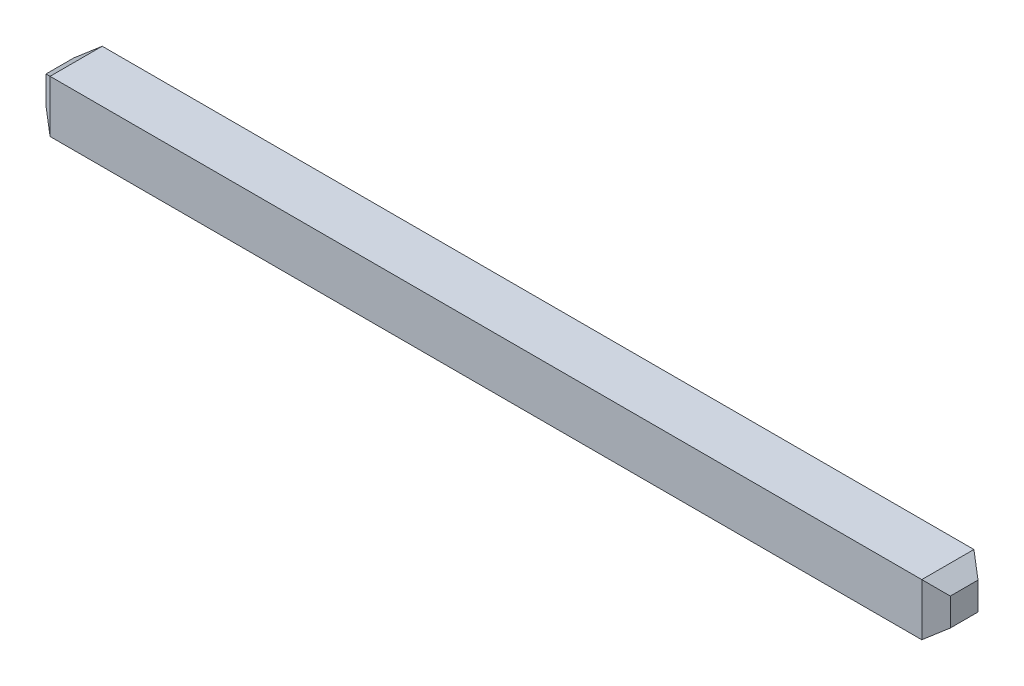
ISO-10303-21;
HEADER;
FILE_DESCRIPTION(('STEP AP214'),'2;1');
FILE_NAME('part.step','',(''),(''),'','','');
FILE_SCHEMA(('AUTOMOTIVE_DESIGN { 1 0 10303 214 1 1 1 1 }'));
ENDSEC;
DATA;
#1=APPLICATION_CONTEXT('core data for automotive mechanical design processes');
#2=APPLICATION_PROTOCOL_DEFINITION('international standard','automotive_design',2000,#1);
#3=PRODUCT_CONTEXT('',#1,'mechanical');
#4=PRODUCT('Part','Part','',(#3));
#5=PRODUCT_RELATED_PRODUCT_CATEGORY('part','',(#4));
#6=PRODUCT_DEFINITION_FORMATION('','',#4);
#7=PRODUCT_DEFINITION_CONTEXT('part definition',#1,'design');
#8=PRODUCT_DEFINITION('design','',#6,#7);
#9=PRODUCT_DEFINITION_SHAPE('','',#8);
#10=(LENGTH_UNIT() NAMED_UNIT(*) SI_UNIT(.MILLI.,.METRE.));
#11=(NAMED_UNIT(*) PLANE_ANGLE_UNIT() SI_UNIT($,.RADIAN.));
#12=(NAMED_UNIT(*) SI_UNIT($,.STERADIAN.) SOLID_ANGLE_UNIT());
#13=UNCERTAINTY_MEASURE_WITH_UNIT(LENGTH_MEASURE(1.E-05),#10,'distance_accuracy_value','');
#14=(GEOMETRIC_REPRESENTATION_CONTEXT(3) GLOBAL_UNCERTAINTY_ASSIGNED_CONTEXT((#13)) GLOBAL_UNIT_ASSIGNED_CONTEXT((#10,
#11,#12)) REPRESENTATION_CONTEXT('',''));
#15=CARTESIAN_POINT('',(0.,0.,0.));
#16=DIRECTION('',(0.,0.,1.));
#17=DIRECTION('',(1.,0.,0.));
#18=AXIS2_PLACEMENT_3D('',#15,#16,#17);
#19=CARTESIAN_POINT('',(-2.4,3.525,-46.99));
#20=DIRECTION('',(0.6,0.8,0.));
#21=DIRECTION('',(-0.8,0.6,0.));
#22=AXIS2_PLACEMENT_3D('',#19,#20,#21);
#23=PLANE('',#22);
#24=DIRECTION('',(0.,0.,1.));
#25=VECTOR('',#24,1.);
#26=CARTESIAN_POINT('',(-2.3,3.45,-46.99));
#27=LINE('',#26,#25);
#28=CARTESIAN_POINT('',(-2.29999999999978,3.45,-47.3099999999997));
#29=VERTEX_POINT('',#28);
#30=CARTESIAN_POINT('',(-2.29999999999978,3.45,-46.6700000000003));
#31=VERTEX_POINT('',#30);
#32=EDGE_CURVE('E105',#29,#31,#27,.T.);
#33=ORIENTED_EDGE('',*,*,#32,.T.);
#34=DIRECTION('',(0.685994340575993,-0.514495755427534,0.514495755419576));
#35=VECTOR('',#34,1.);
#36=CARTESIAN_POINT('',(-2.50000000000087,3.6,-46.8199999999988));
#37=LINE('',#36,#35);
#38=CARTESIAN_POINT('',(-2.50000000000022,3.6,-46.8199999999997));
#39=VERTEX_POINT('',#38);
#40=EDGE_CURVE('E92',#39,#31,#37,.T.);
#41=ORIENTED_EDGE('',*,*,#40,.F.);
#42=DIRECTION('',(0.,0.,-1.));
#43=VECTOR('',#42,1.);
#44=CARTESIAN_POINT('',(-2.5,3.6,-46.99));
#45=LINE('',#44,#43);
#46=CARTESIAN_POINT('',(-2.50000000000043,3.6,-47.1600000000006));
#47=VERTEX_POINT('',#46);
#48=EDGE_CURVE('E79',#39,#47,#45,.T.);
#49=ORIENTED_EDGE('',*,*,#48,.T.);
#50=DIRECTION('',(0.685994340575995,-0.514495755427521,-0.514495755419586));
#51=VECTOR('',#50,1.);
#52=CARTESIAN_POINT('',(-2.50000000000087,3.6,-47.1600000000012));
#53=LINE('',#52,#51);
#54=EDGE_CURVE('E20',#47,#29,#53,.T.);
#55=ORIENTED_EDGE('',*,*,#54,.T.);
#56=EDGE_LOOP('',(#33,#41,#49,#55));
#57=FACE_BOUND('',#56,.T.);
#58=ADVANCED_FACE('F17',(#57),#23,.F.);
#59=CARTESIAN_POINT('',(8.5,3.525,-46.99));
#60=DIRECTION('',(-0.6,0.8,0.));
#61=DIRECTION('',(-0.8,-0.6,0.));
#62=AXIS2_PLACEMENT_3D('',#59,#60,#61);
#63=PLANE('',#62);
#64=DIRECTION('',(0.,0.,-1.));
#65=VECTOR('',#64,1.);
#66=CARTESIAN_POINT('',(8.6,3.6,-46.99));
#67=LINE('',#66,#65);
#68=CARTESIAN_POINT('',(8.60000000000043,3.6,-46.8199999999994));
#69=VERTEX_POINT('',#68);
#70=CARTESIAN_POINT('',(8.60000000000022,3.6,-47.1600000000003));
#71=VERTEX_POINT('',#70);
#72=EDGE_CURVE('E114',#69,#71,#67,.T.);
#73=ORIENTED_EDGE('',*,*,#72,.F.);
#74=DIRECTION('',(0.685994340575992,0.514495755427534,-0.514495755419576));
#75=VECTOR('',#74,1.);
#76=CARTESIAN_POINT('',(8.39999999999913,3.45,-46.6700000000012));
#77=LINE('',#76,#75);
#78=CARTESIAN_POINT('',(8.39999999999989,3.45,-46.6700000000002));
#79=VERTEX_POINT('',#78);
#80=EDGE_CURVE('E109',#79,#69,#77,.T.);
#81=ORIENTED_EDGE('',*,*,#80,.F.);
#82=DIRECTION('',(0.,0.,1.));
#83=VECTOR('',#82,1.);
#84=CARTESIAN_POINT('',(8.4,3.45,-46.99));
#85=LINE('',#84,#83);
#86=CARTESIAN_POINT('',(8.39999999999978,3.45,-47.3099999999997));
#87=VERTEX_POINT('',#86);
#88=EDGE_CURVE('E103',#79,#87,#85,.F.);
#89=ORIENTED_EDGE('',*,*,#88,.T.);
#90=DIRECTION('',(0.685994340575993,0.514495755427522,0.514495755419587));
#91=VECTOR('',#90,1.);
#92=CARTESIAN_POINT('',(8.39999999999913,3.45,-47.3099999999988));
#93=LINE('',#92,#91);
#94=EDGE_CURVE('E107',#87,#71,#93,.T.);
#95=ORIENTED_EDGE('',*,*,#94,.T.);
#96=EDGE_LOOP('',(#73,#81,#89,#95));
#97=FACE_BOUND('',#96,.T.);
#98=ADVANCED_FACE('F175',(#97),#63,.F.);
#99=CARTESIAN_POINT('',(-2.4,3.77,-47.235));
#100=DIRECTION('',(0.599999999990736,0.,0.800000000006948));
#101=DIRECTION('',(0.800000000006948,0.,-0.599999999990736));
#102=AXIS2_PLACEMENT_3D('',#99,#100,#101);
#103=PLANE('',#102);
#104=DIRECTION('',(0.,1.,0.));
#105=VECTOR('',#104,1.);
#106=CARTESIAN_POINT('',(-2.3,3.77,-47.31));
#107=LINE('',#106,#105);
#108=CARTESIAN_POINT('',(-2.29999999999956,4.09,-47.3099999999994));
#109=VERTEX_POINT('',#108);
#110=EDGE_CURVE('E88',#109,#29,#107,.F.);
#111=ORIENTED_EDGE('',*,*,#110,.T.);
#112=ORIENTED_EDGE('',*,*,#54,.F.);
#113=DIRECTION('',(0.,1.,0.));
#114=VECTOR('',#113,1.);
#115=CARTESIAN_POINT('',(-2.5,3.77,-47.16));
#116=LINE('',#115,#114);
#117=CARTESIAN_POINT('',(-2.50000000000043,3.94,-47.1600000000006));
#118=VERTEX_POINT('',#117);
#119=EDGE_CURVE('E85',#47,#118,#116,.T.);
#120=ORIENTED_EDGE('',*,*,#119,.T.);
#121=DIRECTION('',(-0.68599434057003,-0.514495755427522,0.514495755427537));
#122=VECTOR('',#121,1.);
#123=CARTESIAN_POINT('',(-2.3,4.09,-47.31));
#124=LINE('',#123,#122);
#125=EDGE_CURVE('E126',#109,#118,#124,.T.);
#126=ORIENTED_EDGE('',*,*,#125,.F.);
#127=EDGE_LOOP('',(#111,#112,#120,#126));
#128=FACE_BOUND('',#127,.T.);
#129=ADVANCED_FACE('F84',(#128),#103,.F.);
#130=CARTESIAN_POINT('',(-2.5,3.77,-46.99));
#131=DIRECTION('',(1.,0.,0.));
#132=DIRECTION('',(0.,0.,-1.));
#133=AXIS2_PLACEMENT_3D('',#130,#131,#132);
#134=PLANE('',#133);
#135=DIRECTION('',(0.,1.,0.));
#136=VECTOR('',#135,1.);
#137=CARTESIAN_POINT('',(-2.50000000000087,3.77,-46.8199999999988));
#138=LINE('',#137,#136);
#139=CARTESIAN_POINT('',(-2.50000000000022,3.94,-46.8199999999997));
#140=VERTEX_POINT('',#139);
#141=EDGE_CURVE('E94',#140,#39,#138,.F.);
#142=ORIENTED_EDGE('',*,*,#141,.F.);
#143=DIRECTION('',(0.,0.,1.));
#144=VECTOR('',#143,1.);
#145=CARTESIAN_POINT('',(-2.5,3.94,-46.99));
#146=LINE('',#145,#144);
#147=EDGE_CURVE('E98',#118,#140,#146,.T.);
#148=ORIENTED_EDGE('',*,*,#147,.F.);
#149=ORIENTED_EDGE('',*,*,#119,.F.);
#150=ORIENTED_EDGE('',*,*,#48,.F.);
#151=EDGE_LOOP('',(#142,#148,#149,#150));
#152=FACE_BOUND('',#151,.T.);
#153=ADVANCED_FACE('F96',(#152),#134,.F.);
#154=CARTESIAN_POINT('',(-2.4,3.77,-46.745));
#155=DIRECTION('',(-0.599999999990736,0.,0.800000000006948));
#156=DIRECTION('',(0.800000000006948,0.,0.599999999990736));
#157=AXIS2_PLACEMENT_3D('',#154,#155,#156);
#158=PLANE('',#157);
#159=ORIENTED_EDGE('',*,*,#40,.T.);
#160=DIRECTION('',(0.,1.,0.));
#161=VECTOR('',#160,1.);
#162=CARTESIAN_POINT('',(-2.3,3.77,-46.67));
#163=LINE('',#162,#161);
#164=CARTESIAN_POINT('',(-2.29999999999957,4.09,-46.6700000000006));
#165=VERTEX_POINT('',#164);
#166=EDGE_CURVE('E132',#165,#31,#163,.F.);
#167=ORIENTED_EDGE('',*,*,#166,.F.);
#168=DIRECTION('',(0.685994340570039,0.514495755427529,0.51449575542752));
#169=VECTOR('',#168,1.);
#170=CARTESIAN_POINT('',(-2.5,3.94,-46.82));
#171=LINE('',#170,#169);
#172=EDGE_CURVE('E129',#140,#165,#171,.T.);
#173=ORIENTED_EDGE('',*,*,#172,.F.);
#174=ORIENTED_EDGE('',*,*,#141,.T.);
#175=EDGE_LOOP('',(#159,#167,#173,#174));
#176=FACE_BOUND('',#175,.T.);
#177=ADVANCED_FACE('F186',(#176),#158,.T.);
#178=CARTESIAN_POINT('',(3.05,3.45,-46.99));
#179=DIRECTION('',(0.,1.,0.));
#180=DIRECTION('',(0.,0.,1.));
#181=AXIS2_PLACEMENT_3D('',#178,#179,#180);
#182=PLANE('',#181);
#183=ORIENTED_EDGE('',*,*,#32,.F.);
#184=DIRECTION('',(1.,0.,0.));
#185=VECTOR('',#184,1.);
#186=CARTESIAN_POINT('',(3.05,3.45,-47.31));
#187=LINE('',#186,#185);
#188=EDGE_CURVE('E123',#29,#87,#187,.T.);
#189=ORIENTED_EDGE('',*,*,#188,.T.);
#190=ORIENTED_EDGE('',*,*,#88,.F.);
#191=DIRECTION('',(1.,0.,0.));
#192=VECTOR('',#191,1.);
#193=CARTESIAN_POINT('',(3.05,3.45,-46.67));
#194=LINE('',#193,#192);
#195=EDGE_CURVE('E135',#31,#79,#194,.T.);
#196=ORIENTED_EDGE('',*,*,#195,.F.);
#197=EDGE_LOOP('',(#183,#189,#190,#196));
#198=FACE_BOUND('',#197,.T.);
#199=ADVANCED_FACE('F179',(#198),#182,.F.);
#200=CARTESIAN_POINT('',(8.5,3.77,-47.235));
#201=DIRECTION('',(-0.599999999990736,0.,0.800000000006948));
#202=DIRECTION('',(0.800000000006948,0.,0.599999999990736));
#203=AXIS2_PLACEMENT_3D('',#200,#201,#202);
#204=PLANE('',#203);
#205=DIRECTION('',(0.,1.,0.));
#206=VECTOR('',#205,1.);
#207=CARTESIAN_POINT('',(8.6,3.77,-47.16));
#208=LINE('',#207,#206);
#209=CARTESIAN_POINT('',(8.60000000000043,3.94,-47.1600000000006));
#210=VERTEX_POINT('',#209);
#211=EDGE_CURVE('E117',#71,#210,#208,.T.);
#212=ORIENTED_EDGE('',*,*,#211,.F.);
#213=ORIENTED_EDGE('',*,*,#94,.F.);
#214=DIRECTION('',(0.,1.,0.));
#215=VECTOR('',#214,1.);
#216=CARTESIAN_POINT('',(8.4,3.77,-47.31));
#217=LINE('',#216,#215);
#218=CARTESIAN_POINT('',(8.39999999999956,4.09,-47.3099999999994));
#219=VERTEX_POINT('',#218);
#220=EDGE_CURVE('E120',#87,#219,#217,.T.);
#221=ORIENTED_EDGE('',*,*,#220,.T.);
#222=DIRECTION('',(-0.685994340570029,0.514495755427522,-0.51449575542754));
#223=VECTOR('',#222,1.);
#224=CARTESIAN_POINT('',(8.6,3.94,-47.16));
#225=LINE('',#224,#223);
#226=EDGE_CURVE('E140',#210,#219,#225,.T.);
#227=ORIENTED_EDGE('',*,*,#226,.F.);
#228=EDGE_LOOP('',(#212,#213,#221,#227));
#229=FACE_BOUND('',#228,.T.);
#230=ADVANCED_FACE('F167',(#229),#204,.F.);
#231=CARTESIAN_POINT('',(8.5,3.77,-46.745));
#232=DIRECTION('',(0.599999999990736,0.,0.800000000006948));
#233=DIRECTION('',(0.800000000006948,0.,-0.599999999990736));
#234=AXIS2_PLACEMENT_3D('',#231,#232,#233);
#235=PLANE('',#234);
#236=DIRECTION('',(0.685994340570037,-0.514495755427528,-0.514495755427522));
#237=VECTOR('',#236,1.);
#238=CARTESIAN_POINT('',(8.4,4.09,-46.67));
#239=LINE('',#238,#237);
#240=CARTESIAN_POINT('',(8.39999999999957,4.09,-46.6700000000006));
#241=VERTEX_POINT('',#240);
#242=CARTESIAN_POINT('',(8.60000000000043,3.94,-46.8199999999994));
#243=VERTEX_POINT('',#242);
#244=EDGE_CURVE('E35',#241,#243,#239,.T.);
#245=ORIENTED_EDGE('',*,*,#244,.F.);
#246=DIRECTION('',(0.,1.,0.));
#247=VECTOR('',#246,1.);
#248=CARTESIAN_POINT('',(8.4,3.77,-46.67));
#249=LINE('',#248,#247);
#250=EDGE_CURVE('E138',#79,#241,#249,.T.);
#251=ORIENTED_EDGE('',*,*,#250,.F.);
#252=ORIENTED_EDGE('',*,*,#80,.T.);
#253=DIRECTION('',(0.,1.,0.));
#254=VECTOR('',#253,1.);
#255=CARTESIAN_POINT('',(8.6,3.77,-46.82));
#256=LINE('',#255,#254);
#257=EDGE_CURVE('E111',#243,#69,#256,.F.);
#258=ORIENTED_EDGE('',*,*,#257,.F.);
#259=EDGE_LOOP('',(#245,#251,#252,#258));
#260=FACE_BOUND('',#259,.T.);
#261=ADVANCED_FACE('F211',(#260),#235,.T.);
#262=CARTESIAN_POINT('',(8.6,3.77,-46.99));
#263=DIRECTION('',(1.,0.,0.));
#264=DIRECTION('',(0.,0.,-1.));
#265=AXIS2_PLACEMENT_3D('',#262,#263,#264);
#266=PLANE('',#265);
#267=ORIENTED_EDGE('',*,*,#211,.T.);
#268=DIRECTION('',(0.,0.,1.));
#269=VECTOR('',#268,1.);
#270=CARTESIAN_POINT('',(8.6,3.94,-46.99));
#271=LINE('',#270,#269);
#272=EDGE_CURVE('E144',#243,#210,#271,.F.);
#273=ORIENTED_EDGE('',*,*,#272,.F.);
#274=ORIENTED_EDGE('',*,*,#257,.T.);
#275=ORIENTED_EDGE('',*,*,#72,.T.);
#276=EDGE_LOOP('',(#267,#273,#274,#275));
#277=FACE_BOUND('',#276,.T.);
#278=ADVANCED_FACE('F172',(#277),#266,.T.);
#279=CARTESIAN_POINT('',(3.05,3.77,-47.31));
#280=DIRECTION('',(0.,0.,1.));
#281=DIRECTION('',(1.,0.,0.));
#282=AXIS2_PLACEMENT_3D('',#279,#280,#281);
#283=PLANE('',#282);
#284=ORIENTED_EDGE('',*,*,#110,.F.);
#285=DIRECTION('',(1.,0.,0.));
#286=VECTOR('',#285,1.);
#287=CARTESIAN_POINT('',(3.05,4.09,-47.31));
#288=LINE('',#287,#286);
#289=EDGE_CURVE('E147',#219,#109,#288,.F.);
#290=ORIENTED_EDGE('',*,*,#289,.F.);
#291=ORIENTED_EDGE('',*,*,#220,.F.);
#292=ORIENTED_EDGE('',*,*,#188,.F.);
#293=EDGE_LOOP('',(#284,#290,#291,#292));
#294=FACE_BOUND('',#293,.T.);
#295=ADVANCED_FACE('F181',(#294),#283,.F.);
#296=CARTESIAN_POINT('',(-2.4,4.015,-46.99));
#297=DIRECTION('',(-0.6,0.8,0.));
#298=DIRECTION('',(-0.8,-0.6,0.));
#299=AXIS2_PLACEMENT_3D('',#296,#297,#298);
#300=PLANE('',#299);
#301=ORIENTED_EDGE('',*,*,#172,.T.);
#302=DIRECTION('',(0.,0.,1.));
#303=VECTOR('',#302,1.);
#304=CARTESIAN_POINT('',(-2.3,4.09,-46.99));
#305=LINE('',#304,#303);
#306=EDGE_CURVE('E150',#109,#165,#305,.T.);
#307=ORIENTED_EDGE('',*,*,#306,.F.);
#308=ORIENTED_EDGE('',*,*,#125,.T.);
#309=ORIENTED_EDGE('',*,*,#147,.T.);
#310=EDGE_LOOP('',(#301,#307,#308,#309));
#311=FACE_BOUND('',#310,.T.);
#312=ADVANCED_FACE('F183',(#311),#300,.T.);
#313=CARTESIAN_POINT('',(3.05,3.77,-46.67));
#314=DIRECTION('',(0.,0.,1.));
#315=DIRECTION('',(1.,0.,0.));
#316=AXIS2_PLACEMENT_3D('',#313,#314,#315);
#317=PLANE('',#316);
#318=ORIENTED_EDGE('',*,*,#195,.T.);
#319=ORIENTED_EDGE('',*,*,#250,.T.);
#320=DIRECTION('',(1.,0.,0.));
#321=VECTOR('',#320,1.);
#322=CARTESIAN_POINT('',(3.05,4.09,-46.67));
#323=LINE('',#322,#321);
#324=EDGE_CURVE('E26',#165,#241,#323,.T.);
#325=ORIENTED_EDGE('',*,*,#324,.F.);
#326=ORIENTED_EDGE('',*,*,#166,.T.);
#327=EDGE_LOOP('',(#318,#319,#325,#326));
#328=FACE_BOUND('',#327,.T.);
#329=ADVANCED_FACE('F160',(#328),#317,.T.);
#330=CARTESIAN_POINT('',(8.5,4.015,-46.99));
#331=DIRECTION('',(0.6,0.8,0.));
#332=DIRECTION('',(-0.8,0.6,0.));
#333=AXIS2_PLACEMENT_3D('',#330,#331,#332);
#334=PLANE('',#333);
#335=ORIENTED_EDGE('',*,*,#244,.T.);
#336=ORIENTED_EDGE('',*,*,#272,.T.);
#337=ORIENTED_EDGE('',*,*,#226,.T.);
#338=DIRECTION('',(0.,0.,1.));
#339=VECTOR('',#338,1.);
#340=CARTESIAN_POINT('',(8.4,4.09,-46.99));
#341=LINE('',#340,#339);
#342=EDGE_CURVE('E11',#241,#219,#341,.F.);
#343=ORIENTED_EDGE('',*,*,#342,.F.);
#344=EDGE_LOOP('',(#335,#336,#337,#343));
#345=FACE_BOUND('',#344,.T.);
#346=ADVANCED_FACE('F163',(#345),#334,.T.);
#347=CARTESIAN_POINT('',(3.05,4.09,-46.99));
#348=DIRECTION('',(0.,1.,0.));
#349=DIRECTION('',(0.,0.,1.));
#350=AXIS2_PLACEMENT_3D('',#347,#348,#349);
#351=PLANE('',#350);
#352=ORIENTED_EDGE('',*,*,#324,.T.);
#353=ORIENTED_EDGE('',*,*,#342,.T.);
#354=ORIENTED_EDGE('',*,*,#289,.T.);
#355=ORIENTED_EDGE('',*,*,#306,.T.);
#356=EDGE_LOOP('',(#352,#353,#354,#355));
#357=FACE_BOUND('',#356,.T.);
#358=ADVANCED_FACE('F156',(#357),#351,.T.);
#359=CLOSED_SHELL('',(#58,#98,#129,#153,#177,#199,#230,#261,#278,#295,#312,#329,#346,#358));
#360=MANIFOLD_SOLID_BREP('B1',#359);
#361=ADVANCED_BREP_SHAPE_REPRESENTATION('',(#18,#360),#14);
#362=SHAPE_DEFINITION_REPRESENTATION(#9,#361);
ENDSEC;
END-ISO-10303-21;
